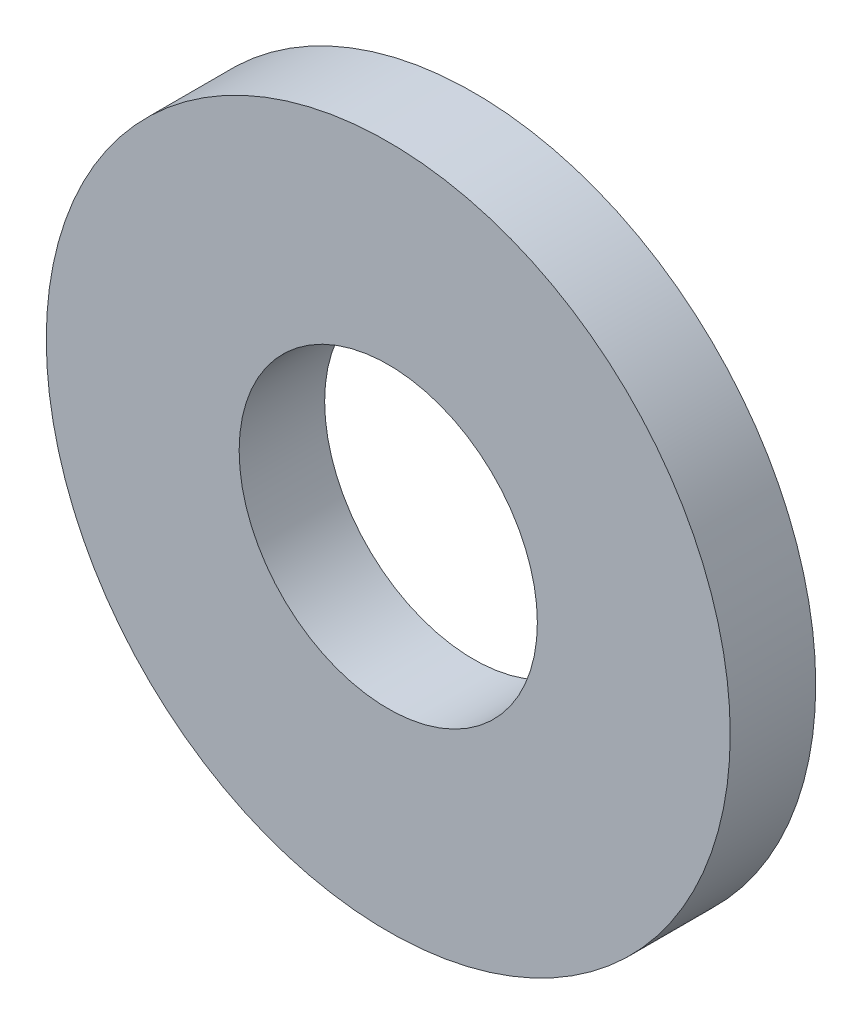
ISO-10303-21;
HEADER;
FILE_DESCRIPTION(('STEP AP214'),'2;1');
FILE_NAME('part.step','',(''),(''),'','','');
FILE_SCHEMA(('AUTOMOTIVE_DESIGN { 1 0 10303 214 1 1 1 1 }'));
ENDSEC;
DATA;
#1=APPLICATION_CONTEXT('core data for automotive mechanical design processes');
#2=APPLICATION_PROTOCOL_DEFINITION('international standard','automotive_design',2000,#1);
#3=PRODUCT_CONTEXT('',#1,'mechanical');
#4=PRODUCT('Part','Part','',(#3));
#5=PRODUCT_RELATED_PRODUCT_CATEGORY('part','',(#4));
#6=PRODUCT_DEFINITION_FORMATION('','',#4);
#7=PRODUCT_DEFINITION_CONTEXT('part definition',#1,'design');
#8=PRODUCT_DEFINITION('design','',#6,#7);
#9=PRODUCT_DEFINITION_SHAPE('','',#8);
#10=(LENGTH_UNIT() NAMED_UNIT(*) SI_UNIT(.MILLI.,.METRE.));
#11=(NAMED_UNIT(*) PLANE_ANGLE_UNIT() SI_UNIT($,.RADIAN.));
#12=(NAMED_UNIT(*) SI_UNIT($,.STERADIAN.) SOLID_ANGLE_UNIT());
#13=UNCERTAINTY_MEASURE_WITH_UNIT(LENGTH_MEASURE(1.E-05),#10,'distance_accuracy_value','');
#14=(GEOMETRIC_REPRESENTATION_CONTEXT(3) GLOBAL_UNCERTAINTY_ASSIGNED_CONTEXT((#13)) GLOBAL_UNIT_ASSIGNED_CONTEXT((#10,
#11,#12)) REPRESENTATION_CONTEXT('',''));
#15=CARTESIAN_POINT('',(0.,0.,0.));
#16=DIRECTION('',(0.,0.,1.));
#17=DIRECTION('',(1.,0.,0.));
#18=AXIS2_PLACEMENT_3D('',#15,#16,#17);
#19=CARTESIAN_POINT('',(0.,0.,0.793749999999996));
#20=DIRECTION('',(0.,0.,1.));
#21=DIRECTION('',(1.,0.,0.));
#22=AXIS2_PLACEMENT_3D('',#19,#20,#21);
#23=PLANE('',#22);
#24=CARTESIAN_POINT('',(0.,0.,0.793749999999996));
#25=DIRECTION('',(0.,0.,1.));
#26=DIRECTION('',(1.,0.,0.));
#27=AXIS2_PLACEMENT_3D('',#24,#25,#26);
#28=CIRCLE('',#27,6.35);
#29=CARTESIAN_POINT('',(6.34999999999999,0.,0.793749999999996));
#30=VERTEX_POINT('',#29);
#31=EDGE_CURVE('E10',#30,#30,#28,.T.);
#32=ORIENTED_EDGE('',*,*,#31,.T.);
#33=EDGE_LOOP('',(#32));
#34=FACE_BOUND('',#33,.T.);
#35=CARTESIAN_POINT('',(0.,0.,0.793749999999996));
#36=DIRECTION('',(0.,0.,1.));
#37=DIRECTION('',(1.,0.,0.));
#38=AXIS2_PLACEMENT_3D('',#35,#36,#37);
#39=CIRCLE('',#38,2.7686);
#40=CARTESIAN_POINT('',(2.76859999999999,0.,0.793749999999996));
#41=VERTEX_POINT('',#40);
#42=EDGE_CURVE('E43',#41,#41,#39,.T.);
#43=ORIENTED_EDGE('',*,*,#42,.F.);
#44=EDGE_LOOP('',(#43));
#45=FACE_BOUND('',#44,.T.);
#46=ADVANCED_FACE('F32',(#34,#45),#23,.T.);
#47=CARTESIAN_POINT('',(0.,0.,-0.793750000000065));
#48=DIRECTION('',(0.,0.,1.));
#49=DIRECTION('',(1.,0.,0.));
#50=AXIS2_PLACEMENT_3D('',#47,#48,#49);
#51=PLANE('',#50);
#52=CARTESIAN_POINT('',(0.,0.,-0.793750000000065));
#53=DIRECTION('',(0.,0.,1.));
#54=DIRECTION('',(1.,0.,0.));
#55=AXIS2_PLACEMENT_3D('',#52,#53,#54);
#56=CIRCLE('',#55,6.35);
#57=CARTESIAN_POINT('',(6.35000000000006,0.,-0.793750000000066));
#58=VERTEX_POINT('',#57);
#59=EDGE_CURVE('E36',#58,#58,#56,.T.);
#60=ORIENTED_EDGE('',*,*,#59,.F.);
#61=EDGE_LOOP('',(#60));
#62=FACE_BOUND('',#61,.T.);
#63=CARTESIAN_POINT('',(0.,0.,-0.793750000000065));
#64=DIRECTION('',(0.,0.,1.));
#65=DIRECTION('',(1.,0.,0.));
#66=AXIS2_PLACEMENT_3D('',#63,#64,#65);
#67=CIRCLE('',#66,2.7686);
#68=CARTESIAN_POINT('',(2.76860000000006,0.,-0.793750000000065));
#69=VERTEX_POINT('',#68);
#70=EDGE_CURVE('E45',#69,#69,#67,.T.);
#71=ORIENTED_EDGE('',*,*,#70,.T.);
#72=EDGE_LOOP('',(#71));
#73=FACE_BOUND('',#72,.T.);
#74=ADVANCED_FACE('F55',(#62,#73),#51,.F.);
#75=CARTESIAN_POINT('',(0.,0.,0.793749999999996));
#76=DIRECTION('',(0.,0.,-1.));
#77=DIRECTION('',(-1.,0.,0.));
#78=AXIS2_PLACEMENT_3D('',#75,#76,#77);
#79=CYLINDRICAL_SURFACE('',#78,6.35);
#80=ORIENTED_EDGE('',*,*,#31,.F.);
#81=EDGE_LOOP('',(#80));
#82=FACE_BOUND('',#81,.T.);
#83=ORIENTED_EDGE('',*,*,#59,.T.);
#84=EDGE_LOOP('',(#83));
#85=FACE_BOUND('',#84,.T.);
#86=ADVANCED_FACE('F34',(#82,#85),#79,.T.);
#87=CARTESIAN_POINT('',(0.,0.,0.793749999999996));
#88=DIRECTION('',(0.,0.,-1.));
#89=DIRECTION('',(-1.,0.,0.));
#90=AXIS2_PLACEMENT_3D('',#87,#88,#89);
#91=CYLINDRICAL_SURFACE('',#90,2.7686);
#92=ORIENTED_EDGE('',*,*,#42,.T.);
#93=EDGE_LOOP('',(#92));
#94=FACE_BOUND('',#93,.T.);
#95=ORIENTED_EDGE('',*,*,#70,.F.);
#96=EDGE_LOOP('',(#95));
#97=FACE_BOUND('',#96,.T.);
#98=ADVANCED_FACE('F51',(#94,#97),#91,.F.);
#99=CLOSED_SHELL('',(#46,#74,#86,#98));
#100=MANIFOLD_SOLID_BREP('B2',#99);
#101=ADVANCED_BREP_SHAPE_REPRESENTATION('',(#18,#100),#14);
#102=SHAPE_DEFINITION_REPRESENTATION(#9,#101);
ENDSEC;
END-ISO-10303-21;
